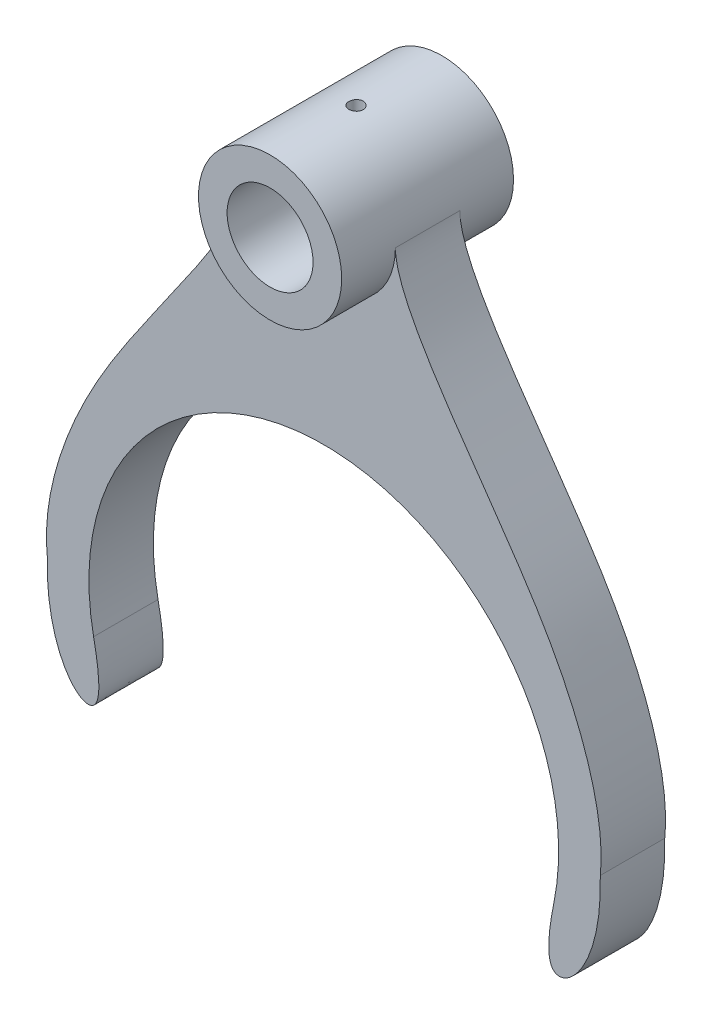
ISO-10303-21;
HEADER;
FILE_DESCRIPTION(('STEP AP214'),'2;1');
FILE_NAME('part.step','',(''),(''),'','','');
FILE_SCHEMA(('AUTOMOTIVE_DESIGN { 1 0 10303 214 1 1 1 1 }'));
ENDSEC;
DATA;
#1=APPLICATION_CONTEXT('core data for automotive mechanical design processes');
#2=APPLICATION_PROTOCOL_DEFINITION('international standard','automotive_design',2000,#1);
#3=PRODUCT_CONTEXT('',#1,'mechanical');
#4=PRODUCT('Part','Part','',(#3));
#5=PRODUCT_RELATED_PRODUCT_CATEGORY('part','',(#4));
#6=PRODUCT_DEFINITION_FORMATION('','',#4);
#7=PRODUCT_DEFINITION_CONTEXT('part definition',#1,'design');
#8=PRODUCT_DEFINITION('design','',#6,#7);
#9=PRODUCT_DEFINITION_SHAPE('','',#8);
#10=(LENGTH_UNIT() NAMED_UNIT(*) SI_UNIT(.MILLI.,.METRE.));
#11=(NAMED_UNIT(*) PLANE_ANGLE_UNIT() SI_UNIT($,.RADIAN.));
#12=(NAMED_UNIT(*) SI_UNIT($,.STERADIAN.) SOLID_ANGLE_UNIT());
#13=UNCERTAINTY_MEASURE_WITH_UNIT(LENGTH_MEASURE(1.E-05),#10,'distance_accuracy_value','');
#14=(GEOMETRIC_REPRESENTATION_CONTEXT(3) GLOBAL_UNCERTAINTY_ASSIGNED_CONTEXT((#13)) GLOBAL_UNIT_ASSIGNED_CONTEXT((#10,
#11,#12)) REPRESENTATION_CONTEXT('',''));
#15=CARTESIAN_POINT('',(0.,0.,0.));
#16=DIRECTION('',(0.,0.,1.));
#17=DIRECTION('',(1.,0.,0.));
#18=AXIS2_PLACEMENT_3D('',#15,#16,#17);
#19=CARTESIAN_POINT('',(0.,154.,30.));
#20=DIRECTION('',(0.,0.,-1.));
#21=DIRECTION('',(-1.,0.,0.));
#22=AXIS2_PLACEMENT_3D('',#19,#20,#21);
#23=CYLINDRICAL_SURFACE('',#22,15.);
#24=CARTESIAN_POINT('',(0.,154.,-30.));
#25=DIRECTION('',(0.,0.,1.));
#26=DIRECTION('',(1.,0.,0.));
#27=AXIS2_PLACEMENT_3D('',#24,#25,#26);
#28=CIRCLE('',#27,15.);
#29=CARTESIAN_POINT('',(15.,154.,-30.));
#30=VERTEX_POINT('',#29);
#31=EDGE_CURVE('E238',#30,#30,#28,.T.);
#32=ORIENTED_EDGE('',*,*,#31,.F.);
#33=EDGE_LOOP('',(#32));
#34=FACE_BOUND('',#33,.T.);
#35=CARTESIAN_POINT('',(0.,154.,30.));
#36=DIRECTION('',(0.,0.,1.));
#37=DIRECTION('',(1.,0.,0.));
#38=AXIS2_PLACEMENT_3D('',#35,#36,#37);
#39=CIRCLE('',#38,15.);
#40=CARTESIAN_POINT('',(15.,154.,30.));
#41=VERTEX_POINT('',#40);
#42=EDGE_CURVE('E237',#41,#41,#39,.T.);
#43=ORIENTED_EDGE('',*,*,#42,.T.);
#44=EDGE_LOOP('',(#43));
#45=FACE_BOUND('',#44,.T.);
#46=CARTESIAN_POINT('',(0.,169.,-2.5));
#47=CARTESIAN_POINT('',(-0.139390904958215,168.999997611688,-2.49999441105218));
#48=CARTESIAN_POINT('',(-0.278857881838821,168.99803677913,-2.48830272503108));
#49=CARTESIAN_POINT('',(-0.553880221673042,168.990403449414,-2.44186434123468));
#50=CARTESIAN_POINT('',(-0.689431867959247,168.984727539239,-2.4070964430884));
#51=CARTESIAN_POINT('',(-0.952604747212644,168.970300682365,-2.31558455140725));
#52=CARTESIAN_POINT('',(-1.0802323684319,168.961552251592,-2.25885853435943));
#53=CARTESIAN_POINT('',(-1.32414184197794,168.941942270821,-2.1250877079476));
#54=CARTESIAN_POINT('',(-1.44042498987859,168.931080962544,-2.048045222517));
#55=CARTESIAN_POINT('',(-1.65947261429168,168.908333174583,-1.87504491617954));
#56=CARTESIAN_POINT('',(-1.76211290353497,168.896438718149,-1.77893088536387));
#57=CARTESIAN_POINT('',(-1.94988849865993,168.873026268767,-1.57085203152719));
#58=CARTESIAN_POINT('',(-2.03502269939097,168.861508299627,-1.45888620854339));
#59=CARTESIAN_POINT('',(-2.18586712560513,168.840075657598,-1.22142903380294));
#60=CARTESIAN_POINT('',(-2.251454552861,168.830171290916,-1.09585866319524));
#61=CARTESIAN_POINT('',(-2.36055836541122,168.813197897947,-0.835290435699374));
#62=CARTESIAN_POINT('',(-2.40407624156561,168.806128680143,-0.700293216322368));
#63=CARTESIAN_POINT('',(-2.46741437778481,168.795705368428,-0.426019725143461));
#64=CARTESIAN_POINT('',(-2.4874490291354,168.792317684857,-0.286794263498608));
#65=CARTESIAN_POINT('',(-2.50391672528988,168.789539389366,-0.00691972311652882));
#66=CARTESIAN_POINT('',(-2.500351440389,168.790148494572,0.133729254167299));
#67=CARTESIAN_POINT('',(-2.46989509839615,168.795264288636,0.410927861275448));
#68=CARTESIAN_POINT('',(-2.44324488188977,168.799730733189,0.547504803545233));
#69=CARTESIAN_POINT('',(-2.36775314040345,168.81199495211,0.814221317829133));
#70=CARTESIAN_POINT('',(-2.31891085431974,168.819792840733,0.944360668888546));
#71=CARTESIAN_POINT('',(-2.20017724609391,168.837884793341,1.19522882344092));
#72=CARTESIAN_POINT('',(-2.13018591387972,168.848190671073,1.31590940608122));
#73=CARTESIAN_POINT('',(-1.97121201755744,168.87012918415,1.54390440053838));
#74=CARTESIAN_POINT('',(-1.88222792065429,168.881761926543,1.65121773245493));
#75=CARTESIAN_POINT('',(-1.68648221215905,168.905220278798,1.85082608580735));
#76=CARTESIAN_POINT('',(-1.57951396387313,168.917046492317,1.94291851854008));
#77=CARTESIAN_POINT('',(-1.35153524898165,168.939426013967,2.10787776266534));
#78=CARTESIAN_POINT('',(-1.23052469190642,168.949979313898,2.18074445018323));
#79=CARTESIAN_POINT('',(-0.977705916166711,168.968638928929,2.30520222713628));
#80=CARTESIAN_POINT('',(-0.845888725564661,168.976743184074,2.35677541933126));
#81=CARTESIAN_POINT('',(-0.575298345602731,168.989575030127,2.43699421524598));
#82=CARTESIAN_POINT('',(-0.436525739179468,168.994302903505,2.46564173697372));
#83=CARTESIAN_POINT('',(-0.157709901301623,168.999811298427,2.49892135846113));
#84=CARTESIAN_POINT('',(-0.0177007371510113,169.000637530128,2.50383157180561));
#85=CARTESIAN_POINT('',(0.261139772889887,168.998374744212,2.49023865557188));
#86=CARTESIAN_POINT('',(0.399971163892038,168.995285877241,2.47173642686626));
#87=CARTESIAN_POINT('',(0.671656175546764,168.985568269382,2.41207515066452));
#88=CARTESIAN_POINT('',(0.80454086838538,168.978961048013,2.37105379160987));
#89=CARTESIAN_POINT('',(1.06154688486044,168.962944644554,2.26766548180047));
#90=CARTESIAN_POINT('',(1.18566771590972,168.95353530512,2.20529733236473));
#91=CARTESIAN_POINT('',(1.42283068946896,168.932845163024,2.06034887530321));
#92=CARTESIAN_POINT('',(1.53576525093715,168.92154855887,1.97759484383275));
#93=CARTESIAN_POINT('',(1.74624358550269,168.898384673919,1.79446268461494));
#94=CARTESIAN_POINT('',(1.84378623969658,168.886517351715,1.69408327672333));
#95=CARTESIAN_POINT('',(2.021742779658,168.863401752358,1.47730245192858));
#96=CARTESIAN_POINT('',(2.10196876111372,168.852161161371,1.36074583448559));
#97=CARTESIAN_POINT('',(2.24170231029499,168.831715297779,1.11564703086146));
#98=CARTESIAN_POINT('',(2.30121053476982,168.82250996066,0.987105224772504));
#99=CARTESIAN_POINT('',(2.39753833147315,168.807234536977,0.722210267187867));
#100=CARTESIAN_POINT('',(2.43445143254795,168.801151543111,0.585891904969511));
#101=CARTESIAN_POINT('',(2.48483545377828,168.792777168353,0.308879870778237));
#102=CARTESIAN_POINT('',(2.49830841194617,168.790485457827,0.168186580267947));
#103=CARTESIAN_POINT('',(2.50137286604735,168.78996733084,-0.11170516596241));
#104=CARTESIAN_POINT('',(2.49126013612519,168.791690565057,-0.25090037857529));
#105=CARTESIAN_POINT('',(2.44807983895685,168.798897814537,-0.525579248050767));
#106=CARTESIAN_POINT('',(2.41501234611248,168.804381817612,-0.661062916941873));
#107=CARTESIAN_POINT('',(2.3269744895949,168.818473562817,-0.924358437292616));
#108=CARTESIAN_POINT('',(2.27202959060044,168.827077672197,-1.05217901005603));
#109=CARTESIAN_POINT('',(2.14182700391591,168.846443689222,-1.29683566919485));
#110=CARTESIAN_POINT('',(2.06656830874856,168.857205703884,-1.41367121037214));
#111=CARTESIAN_POINT('',(1.89681888437215,168.879834540456,-1.63453558310776));
#112=CARTESIAN_POINT('',(1.80211056359364,168.891712955763,-1.73839601670028));
#113=CARTESIAN_POINT('',(1.59660903138023,168.915143723608,-1.92885160447494));
#114=CARTESIAN_POINT('',(1.48581211291263,168.926696000266,-2.01544276863817));
#115=CARTESIAN_POINT('',(1.25036916964028,168.948265296422,-2.16944826819995));
#116=CARTESIAN_POINT('',(1.12563278753281,168.958271162531,-2.23672603931295));
#117=CARTESIAN_POINT('',(0.866513069378977,168.975511676018,-2.34926948460992));
#118=CARTESIAN_POINT('',(0.732139494830006,168.982749081775,-2.3945570810797));
#119=CARTESIAN_POINT('',(0.497703310045399,168.99205790833,-2.45200527412667));
#120=CARTESIAN_POINT('',(0.399058830298446,168.995020272734,-2.46997446961596));
#121=CARTESIAN_POINT('',(0.200289310319808,168.998992159861,-2.49397373784475));
#122=CARTESIAN_POINT('',(0.100164295608494,169.000001716206,-2.50000401613736));
#123=CARTESIAN_POINT('',(0.,169.,-2.5));
#124=B_SPLINE_CURVE_WITH_KNOTS('',3,(#46,#47,#48,#49,#50,#51,#52,#53,#54,#55,#56,#57,#58,#59,
#60,#61,#62,#63,#64,#65,#66,#67,#68,#69,#70,#71,#72,#73,#74,#75,#76,#77,#78,#79,#80,#81,#82,#83,
#84,#85,#86,#87,#88,#89,#90,#91,#92,#93,#94,#95,#96,#97,#98,#99,#100,#101,#102,#103,#104,#105,
#106,#107,#108,#109,#110,#111,#112,#113,#114,#115,#116,#117,#118,#119,#120,#121,#122,#123),
.UNSPECIFIED.,.T.,.F.,(4,2,2,2,2,2,2,2,2,2,2,2,2,2,2,2,2,2,2,2,2,2,2,2,2,2,2,2,2,2,2,2,2,2,2,2,
2,2,4),(0.,0.417806584938509,0.83599754569542,1.25384686702527,1.67164841267479,
2.09302491062332,2.51442800169856,2.9384252082384,3.36239376876181,3.78246077103424,
4.20249804320886,4.61820521760409,5.03392665025381,5.45164556632557,5.86939820680573,
6.29232769911326,6.71525991635847,7.13854688915903,7.56179844521149,7.98007883491397,
8.39834313035859,8.81407807006415,9.22983635826066,9.64926825627024,10.0687306305428,
10.4925382200762,10.9163323737594,11.3383602234177,11.7603513778662,12.177079095227,
12.5938054618813,13.0100481822622,13.4263115502934,13.8475138419339,14.2688133387897,
14.693022316072,15.1168075213007,15.4170424816402,15.7172722727697),.UNSPECIFIED.);
#125=CARTESIAN_POINT('',(0.,169.,-2.5));
#126=VERTEX_POINT('',#125);
#127=EDGE_CURVE('E242',#126,#126,#124,.T.);
#128=ORIENTED_EDGE('',*,*,#127,.T.);
#129=EDGE_LOOP('',(#128));
#130=FACE_BOUND('',#129,.T.);
#131=ADVANCED_FACE('F45',(#34,#45,#130),#23,.F.);
#132=CARTESIAN_POINT('',(0.,154.,30.));
#133=DIRECTION('',(0.,0.,-1.));
#134=DIRECTION('',(-1.,0.,0.));
#135=AXIS2_PLACEMENT_3D('',#132,#133,#134);
#136=CYLINDRICAL_SURFACE('',#135,25.);
#137=CARTESIAN_POINT('',(0.,154.,11.25));
#138=DIRECTION('',(0.,0.,1.));
#139=DIRECTION('',(1.,0.,0.));
#140=AXIS2_PLACEMENT_3D('',#137,#138,#139);
#141=CIRCLE('',#140,25.);
#142=CARTESIAN_POINT('',(-25.,154.,11.25));
#143=VERTEX_POINT('',#142);
#144=CARTESIAN_POINT('',(25.,154.,11.25));
#145=VERTEX_POINT('',#144);
#146=EDGE_CURVE('E219',#143,#145,#141,.T.);
#147=ORIENTED_EDGE('',*,*,#146,.T.);
#148=DIRECTION('',(0.,0.,-1.));
#149=VECTOR('',#148,1.);
#150=CARTESIAN_POINT('',(25.,154.,11.25));
#151=LINE('',#150,#149);
#152=CARTESIAN_POINT('',(25.,154.,-11.25));
#153=VERTEX_POINT('',#152);
#154=EDGE_CURVE('E116',#145,#153,#151,.T.);
#155=ORIENTED_EDGE('',*,*,#154,.T.);
#156=CARTESIAN_POINT('',(0.,154.,-11.25));
#157=DIRECTION('',(0.,0.,1.));
#158=DIRECTION('',(1.,0.,0.));
#159=AXIS2_PLACEMENT_3D('',#156,#157,#158);
#160=CIRCLE('',#159,25.);
#161=CARTESIAN_POINT('',(-25.,154.,-11.25));
#162=VERTEX_POINT('',#161);
#163=EDGE_CURVE('E109',#162,#153,#160,.T.);
#164=ORIENTED_EDGE('',*,*,#163,.F.);
#165=DIRECTION('',(0.,0.,-1.));
#166=VECTOR('',#165,1.);
#167=CARTESIAN_POINT('',(-25.,154.,11.25));
#168=LINE('',#167,#166);
#169=EDGE_CURVE('E113',#143,#162,#168,.T.);
#170=ORIENTED_EDGE('',*,*,#169,.F.);
#171=EDGE_LOOP('',(#147,#155,#164,#170));
#172=FACE_BOUND('',#171,.T.);
#173=CARTESIAN_POINT('',(0.,154.,30.));
#174=DIRECTION('',(0.,0.,1.));
#175=DIRECTION('',(1.,0.,0.));
#176=AXIS2_PLACEMENT_3D('',#173,#174,#175);
#177=CIRCLE('',#176,25.);
#178=CARTESIAN_POINT('',(25.,154.,30.));
#179=VERTEX_POINT('',#178);
#180=EDGE_CURVE('E171',#179,#179,#177,.T.);
#181=ORIENTED_EDGE('',*,*,#180,.F.);
#182=EDGE_LOOP('',(#181));
#183=FACE_BOUND('',#182,.T.);
#184=CARTESIAN_POINT('',(0.,154.,-30.));
#185=DIRECTION('',(0.,0.,1.));
#186=DIRECTION('',(1.,0.,0.));
#187=AXIS2_PLACEMENT_3D('',#184,#185,#186);
#188=CIRCLE('',#187,25.);
#189=CARTESIAN_POINT('',(25.,154.,-30.));
#190=VERTEX_POINT('',#189);
#191=EDGE_CURVE('E233',#190,#190,#188,.T.);
#192=ORIENTED_EDGE('',*,*,#191,.T.);
#193=EDGE_LOOP('',(#192));
#194=FACE_BOUND('',#193,.T.);
#195=CARTESIAN_POINT('',(0.,179.,-2.5));
#196=CARTESIAN_POINT('',(-0.140050884478893,178.999998388019,-2.49999393524905));
#197=CARTESIAN_POINT('',(-0.280194362919432,178.998810639905,-2.48819182775889));
#198=CARTESIAN_POINT('',(-0.556595996242092,178.994186689868,-2.44128907427393));
#199=CARTESIAN_POINT('',(-0.69284969792207,178.990748010851,-2.40616275993853));
#200=CARTESIAN_POINT('',(-0.957429188633536,178.982010364077,-2.31364439850542));
#201=CARTESIAN_POINT('',(-1.08575971153727,178.976712520018,-2.25626579870381));
#202=CARTESIAN_POINT('',(-1.33094040240102,178.964848934858,-2.12089773017089));
#203=CARTESIAN_POINT('',(-1.44779284694769,178.958283445953,-2.04291235999965));
#204=CARTESIAN_POINT('',(-1.66714887668521,178.944593608533,-1.86824325584431));
#205=CARTESIAN_POINT('',(-1.76960536208723,178.937467539347,-1.77150050149491));
#206=CARTESIAN_POINT('',(-1.95685630357746,178.923473922657,-1.56218866434242));
#207=CARTESIAN_POINT('',(-2.04164994270663,178.916606387123,-1.44961884989403));
#208=CARTESIAN_POINT('',(-2.19133492610904,178.90388978882,-1.21155367079095));
#209=CARTESIAN_POINT('',(-2.2561836636372,178.898042917773,-1.08603138976285));
#210=CARTESIAN_POINT('',(-2.3638659618569,178.888050938663,-0.825811035237551));
#211=CARTESIAN_POINT('',(-2.40670006647823,178.883905788556,-0.691113188540124));
#212=CARTESIAN_POINT('',(-2.46899760400473,178.877802101824,-0.416845497834975));
#213=CARTESIAN_POINT('',(-2.48853913250949,178.875836259952,-0.277293557869479));
#214=CARTESIAN_POINT('',(-2.5039382128384,178.874291076513,0.0031221584894524));
#215=CARTESIAN_POINT('',(-2.499796387177,178.874711672219,0.143985900305149));
#216=CARTESIAN_POINT('',(-2.4680107006317,178.877885172473,0.422488274233297));
#217=CARTESIAN_POINT('',(-2.44045211031138,178.880629614766,0.560136748321736));
#218=CARTESIAN_POINT('',(-2.36274786037646,178.888128357185,0.828844908002736));
#219=CARTESIAN_POINT('',(-2.31260189563936,178.892882684462,0.959904504562579));
#220=CARTESIAN_POINT('',(-2.19105223470377,178.903875236302,1.21198396824722));
#221=CARTESIAN_POINT('',(-2.11961070679995,178.910116097704,1.33298547372329));
#222=CARTESIAN_POINT('',(-1.95752506838307,178.923376293322,1.56131303727971));
#223=CARTESIAN_POINT('',(-1.86688039584126,178.93039565032,1.66863869495441));
#224=CARTESIAN_POINT('',(-1.66848528103017,178.944459632825,1.86706348497257));
#225=CARTESIAN_POINT('',(-1.56066119712841,178.951504233325,1.95808900470201));
#226=CARTESIAN_POINT('',(-1.33122370434278,178.964795726963,2.12075908227597));
#227=CARTESIAN_POINT('',(-1.209610279999,178.971042619206,2.19240361839119));
#228=CARTESIAN_POINT('',(-0.955995264230911,178.982036891677,2.31427505077563));
#229=CARTESIAN_POINT('',(-0.823991865974757,178.986784010369,2.36449821204515));
#230=CARTESIAN_POINT('',(-0.553368043324829,178.994241186035,2.44204729177938));
#231=CARTESIAN_POINT('',(-0.4147478169415,178.996951303927,2.46937389497656));
#232=CARTESIAN_POINT('',(-0.135462747729759,179.000021291708,2.50026076933691));
#233=CARTESIAN_POINT('',(0.00519075526373084,179.000391206693,2.50392262063125));
#234=CARTESIAN_POINT('',(0.28510948328925,178.99876604392,2.48764284237809));
#235=CARTESIAN_POINT('',(0.424374727051175,178.996770998112,2.4677015317118));
#236=CARTESIAN_POINT('',(0.697270517086686,178.99064653848,2.40486576144606));
#237=CARTESIAN_POINT('',(0.830912122430047,178.986521547951,2.36201886380497));
#238=CARTESIAN_POINT('',(1.08911080345945,178.976599971515,2.25463706490682));
#239=CARTESIAN_POINT('',(1.21366767539279,178.970803348131,2.19010167740151));
#240=CARTESIAN_POINT('',(1.45062045043035,178.958161883261,2.04092290334022));
#241=CARTESIAN_POINT('',(1.56297414937229,178.951313590086,1.95621277768546));
#242=CARTESIAN_POINT('',(1.77190405827969,178.937348321738,1.76918483064768));
#243=CARTESIAN_POINT('',(1.86847987212294,178.930231339824,1.66686656732421));
#244=CARTESIAN_POINT('',(2.04346527471786,178.916500603519,1.4470835633525));
#245=CARTESIAN_POINT('',(2.12180819669886,178.909888753474,1.32956560864345));
#246=CARTESIAN_POINT('',(2.25764564685957,178.897945811522,1.08298159963329));
#247=CARTESIAN_POINT('',(2.31514046013471,178.892614702101,0.95391570327901));
#248=CARTESIAN_POINT('',(2.40753802171119,178.883848690851,0.688128151335515));
#249=CARTESIAN_POINT('',(2.44248043702965,178.880410461245,0.551420399772198));
#250=CARTESIAN_POINT('',(2.48891001782366,178.875809132072,0.27404200509807));
#251=CARTESIAN_POINT('',(2.50039785599879,178.874645967255,0.133371475760815));
#252=CARTESIAN_POINT('',(2.49958284617814,178.874727827689,-0.147276720891762));
#253=CARTESIAN_POINT('',(2.48738472398278,178.875962252175,-0.287254707207038));
#254=CARTESIAN_POINT('',(2.43976363240913,178.880677597239,-0.56316229292072));
#255=CARTESIAN_POINT('',(2.4043406369054,178.884158520343,-0.699091887764949));
#256=CARTESIAN_POINT('',(2.31130421574376,178.89297170658,-0.963043372619642));
#257=CARTESIAN_POINT('',(2.25369386085229,178.898303713509,-1.09106635407431));
#258=CARTESIAN_POINT('',(2.11792888727761,178.910218795984,-1.33564222917759));
#259=CARTESIAN_POINT('',(2.03977438363854,178.916801864524,-1.45219518705157));
#260=CARTESIAN_POINT('',(1.86474639071333,178.930512180242,-1.67105918617984));
#261=CARTESIAN_POINT('',(1.76779487222567,178.937641618169,-1.77330769091772));
#262=CARTESIAN_POINT('',(1.55807924806277,178.95162136822,-1.96013058174914));
#263=CARTESIAN_POINT('',(1.44531136027064,178.958471613074,-2.04470072839292));
#264=CARTESIAN_POINT('',(1.20685358540322,178.971139051729,-2.19393363463655));
#265=CARTESIAN_POINT('',(1.08113187336691,178.97695360067,-2.25854572736296));
#266=CARTESIAN_POINT('',(0.820645697751378,178.986865731247,-2.36565605705967));
#267=CARTESIAN_POINT('',(0.685891624564023,178.990965247741,-2.40817922738387));
#268=CARTESIAN_POINT('',(0.45864565351426,178.995955344343,-2.459301542712));
#269=CARTESIAN_POINT('',(0.367606382111272,178.997465017296,-2.47454261074839));
#270=CARTESIAN_POINT('',(0.184391452043283,178.99948787377,-2.4948938151544));
#271=CARTESIAN_POINT('',(0.0922157980663947,179.000001061401,-2.50000399330465));
#272=CARTESIAN_POINT('',(0.,179.,-2.5));
#273=B_SPLINE_CURVE_WITH_KNOTS('',3,(#195,#196,#197,#198,#199,#200,#201,#202,#203,#204,#205,
#206,#207,#208,#209,#210,#211,#212,#213,#214,#215,#216,#217,#218,#219,#220,#221,#222,#223,#224,
#225,#226,#227,#228,#229,#230,#231,#232,#233,#234,#235,#236,#237,#238,#239,#240,#241,#242,#243,
#244,#245,#246,#247,#248,#249,#250,#251,#252,#253,#254,#255,#256,#257,#258,#259,#260,#261,#262,
#263,#264,#265,#266,#267,#268,#269,#270,#271,#272),.UNSPECIFIED.,.T.,.F.,(4,2,2,2,2,2,2,2,2,2,2,
2,2,2,2,2,2,2,2,2,2,2,2,2,2,2,2,2,2,2,2,2,2,2,2,2,2,2,4),(0.,0.419815915671184,
0.840094607088716,1.26011971433051,1.68006134395696,2.10134642155737,2.52265098051765,
2.94484938680555,3.3670373610626,3.78780580112992,4.20856318139441,4.62779493602776,
5.04703235404084,5.46701903432237,5.88701800827813,6.30886835490517,6.7307191744943,
7.15264351733954,7.57455524188599,7.99465471519394,8.41474851297859,8.83397338235762,
9.25320765123667,9.67384851871746,10.0944999452557,10.516666090215,10.9388264618844,
11.3602422648251,11.7816459809896,12.2011907323489,12.620735955651,13.04022313407,
13.459707963474,13.8809729356913,14.3023388159239,14.7247657756561,15.1467148698824,
15.4231416808087,15.6995673517257),.UNSPECIFIED.);
#274=CARTESIAN_POINT('',(0.,179.,-2.5));
#275=VERTEX_POINT('',#274);
#276=EDGE_CURVE('E11',#275,#275,#273,.T.);
#277=ORIENTED_EDGE('',*,*,#276,.F.);
#278=EDGE_LOOP('',(#277));
#279=FACE_BOUND('',#278,.T.);
#280=ADVANCED_FACE('F111',(#172,#183,#194,#279),#136,.T.);
#281=CARTESIAN_POINT('',(0.,0.,11.25));
#282=DIRECTION('',(0.,0.,-1.));
#283=DIRECTION('',(-1.,0.,0.));
#284=AXIS2_PLACEMENT_3D('',#281,#282,#283);
#285=CYLINDRICAL_SURFACE('',#284,82.);
#286=CARTESIAN_POINT('',(0.,0.,-11.25));
#287=DIRECTION('',(0.,0.,1.));
#288=DIRECTION('',(1.,0.,0.));
#289=AXIS2_PLACEMENT_3D('',#286,#287,#288);
#290=CIRCLE('',#289,82.);
#291=CARTESIAN_POINT('',(80.3693461483978,-16.271699348225,-11.25));
#292=VERTEX_POINT('',#291);
#293=CARTESIAN_POINT('',(-80.3693461483978,-16.271699348225,-11.25));
#294=VERTEX_POINT('',#293);
#295=EDGE_CURVE('E169',#292,#294,#290,.T.);
#296=ORIENTED_EDGE('',*,*,#295,.F.);
#297=DIRECTION('',(0.,0.,-1.));
#298=VECTOR('',#297,1.);
#299=CARTESIAN_POINT('',(80.3693461483978,-16.271699348225,11.25));
#300=LINE('',#299,#298);
#301=CARTESIAN_POINT('',(80.3693461483978,-16.271699348225,11.25));
#302=VERTEX_POINT('',#301);
#303=EDGE_CURVE('E60',#302,#292,#300,.T.);
#304=ORIENTED_EDGE('',*,*,#303,.F.);
#305=CARTESIAN_POINT('',(0.,0.,11.25));
#306=DIRECTION('',(0.,0.,1.));
#307=DIRECTION('',(1.,0.,0.));
#308=AXIS2_PLACEMENT_3D('',#305,#306,#307);
#309=CIRCLE('',#308,82.);
#310=CARTESIAN_POINT('',(-80.3693461483978,-16.271699348225,11.25));
#311=VERTEX_POINT('',#310);
#312=EDGE_CURVE('E138',#302,#311,#309,.T.);
#313=ORIENTED_EDGE('',*,*,#312,.T.);
#314=DIRECTION('',(0.,0.,-1.));
#315=VECTOR('',#314,1.);
#316=CARTESIAN_POINT('',(-80.3693461483978,-16.271699348225,11.25));
#317=LINE('',#316,#315);
#318=EDGE_CURVE('E95',#311,#294,#317,.T.);
#319=ORIENTED_EDGE('',*,*,#318,.T.);
#320=EDGE_LOOP('',(#296,#304,#313,#319));
#321=FACE_BOUND('',#320,.T.);
#322=ADVANCED_FACE('F47',(#321),#285,.F.);
#323=CARTESIAN_POINT('',(96.5397451551416,0.,11.25));
#324=CARTESIAN_POINT('',(97.326558794436,-29.3315351381724,11.25));
#325=CARTESIAN_POINT('',(77.4734920497256,-47.5739427436133,11.25));
#326=CARTESIAN_POINT('',(78.1124793524224,-27.4188392292452,11.25));
#327=CARTESIAN_POINT('',(80.3693461483977,-16.271699348225,11.25));
#328=B_SPLINE_CURVE_WITH_KNOTS('',3,(#323,#324,#325,#326,#327),.UNSPECIFIED.,.F.,.F.,(4,1,4),
(0.,0.663724028871257,1.),.UNSPECIFIED.);
#329=DIRECTION('',(0.,0.,-1.));
#330=VECTOR('',#329,1.);
#331=SURFACE_OF_LINEAR_EXTRUSION('',#328,#330);
#332=CARTESIAN_POINT('',(96.5397451551416,0.,-11.25));
#333=CARTESIAN_POINT('',(97.326558794436,-29.3315351381724,-11.25));
#334=CARTESIAN_POINT('',(77.4734920497256,-47.5739427436133,-11.25));
#335=CARTESIAN_POINT('',(78.1124793524224,-27.4188392292452,-11.25));
#336=CARTESIAN_POINT('',(80.3693461483977,-16.271699348225,-11.25));
#337=B_SPLINE_CURVE_WITH_KNOTS('',3,(#332,#333,#334,#335,#336),.UNSPECIFIED.,.F.,.F.,(4,1,4),
(0.,0.663724028871257,1.),.UNSPECIFIED.);
#338=CARTESIAN_POINT('',(96.5397451551416,0.,-11.25));
#339=VERTEX_POINT('',#338);
#340=EDGE_CURVE('E166',#339,#292,#337,.T.);
#341=ORIENTED_EDGE('',*,*,#340,.F.);
#342=DIRECTION('',(0.,0.,-1.));
#343=VECTOR('',#342,1.);
#344=CARTESIAN_POINT('',(96.5397451551416,0.,11.25));
#345=LINE('',#344,#343);
#346=CARTESIAN_POINT('',(96.5397451551416,0.,11.25));
#347=VERTEX_POINT('',#346);
#348=EDGE_CURVE('E158',#347,#339,#345,.T.);
#349=ORIENTED_EDGE('',*,*,#348,.F.);
#350=EDGE_CURVE('E168',#347,#302,#328,.T.);
#351=ORIENTED_EDGE('',*,*,#350,.T.);
#352=ORIENTED_EDGE('',*,*,#303,.T.);
#353=EDGE_LOOP('',(#341,#349,#351,#352));
#354=FACE_BOUND('',#353,.T.);
#355=ADVANCED_FACE('F164',(#354),#331,.T.);
#356=CARTESIAN_POINT('',(96.5397451551416,0.,11.25));
#357=CARTESIAN_POINT('',(96.4933319207442,1.73023362536728,11.25));
#358=CARTESIAN_POINT('',(104.346209231327,42.2228603518084,11.25));
#359=CARTESIAN_POINT('',(25.,135.629553039424,11.25));
#360=CARTESIAN_POINT('',(25.,154.,11.25));
#361=B_SPLINE_CURVE_WITH_KNOTS('',3,(#356,#357,#358,#359,#360),.UNSPECIFIED.,.F.,.F.,(4,1,4),
(0.,0.598565742576659,1.),.UNSPECIFIED.);
#362=DIRECTION('',(0.,0.,-1.));
#363=VECTOR('',#362,1.);
#364=SURFACE_OF_LINEAR_EXTRUSION('',#361,#363);
#365=CARTESIAN_POINT('',(96.5397451551416,0.,-11.25));
#366=CARTESIAN_POINT('',(96.4933319207442,1.73023362536728,-11.25));
#367=CARTESIAN_POINT('',(104.346209231327,42.2228603518084,-11.25));
#368=CARTESIAN_POINT('',(25.,135.629553039424,-11.25));
#369=CARTESIAN_POINT('',(25.,154.,-11.25));
#370=B_SPLINE_CURVE_WITH_KNOTS('',3,(#365,#366,#367,#368,#369),.UNSPECIFIED.,.F.,.F.,(4,1,4),
(0.,0.598565742576659,1.),.UNSPECIFIED.);
#371=EDGE_CURVE('E123',#339,#153,#370,.T.);
#372=ORIENTED_EDGE('',*,*,#371,.T.);
#373=ORIENTED_EDGE('',*,*,#154,.F.);
#374=EDGE_CURVE('E213',#347,#145,#361,.T.);
#375=ORIENTED_EDGE('',*,*,#374,.F.);
#376=ORIENTED_EDGE('',*,*,#348,.T.);
#377=EDGE_LOOP('',(#372,#373,#375,#376));
#378=FACE_BOUND('',#377,.T.);
#379=ADVANCED_FACE('F208',(#378),#364,.F.);
#380=CARTESIAN_POINT('',(-96.5397451551416,0.,11.25));
#381=CARTESIAN_POINT('',(-96.4933319207442,1.73023362536728,11.25));
#382=CARTESIAN_POINT('',(-104.346209231327,42.2228603518084,11.25));
#383=CARTESIAN_POINT('',(-25.,135.629553039424,11.25));
#384=CARTESIAN_POINT('',(-25.,154.,11.25));
#385=B_SPLINE_CURVE_WITH_KNOTS('',3,(#380,#381,#382,#383,#384),.UNSPECIFIED.,.F.,.F.,(4,1,4),
(0.,0.598565742576659,1.),.UNSPECIFIED.);
#386=DIRECTION('',(0.,0.,-1.));
#387=VECTOR('',#386,1.);
#388=SURFACE_OF_LINEAR_EXTRUSION('',#385,#387);
#389=CARTESIAN_POINT('',(-96.5397451551416,0.,-11.25));
#390=CARTESIAN_POINT('',(-96.4933319207442,1.73023362536728,-11.25));
#391=CARTESIAN_POINT('',(-104.346209231327,42.2228603518084,-11.25));
#392=CARTESIAN_POINT('',(-25.,135.629553039424,-11.25));
#393=CARTESIAN_POINT('',(-25.,154.,-11.25));
#394=B_SPLINE_CURVE_WITH_KNOTS('',3,(#389,#390,#391,#392,#393),.UNSPECIFIED.,.F.,.F.,(4,1,4),
(0.,0.598565742576659,1.),.UNSPECIFIED.);
#395=CARTESIAN_POINT('',(-96.5397451551416,0.,-11.25));
#396=VERTEX_POINT('',#395);
#397=EDGE_CURVE('E122',#396,#162,#394,.T.);
#398=ORIENTED_EDGE('',*,*,#397,.F.);
#399=DIRECTION('',(0.,0.,-1.));
#400=VECTOR('',#399,1.);
#401=CARTESIAN_POINT('',(-96.5397451551416,0.,11.25));
#402=LINE('',#401,#400);
#403=CARTESIAN_POINT('',(-96.5397451551416,0.,11.25));
#404=VERTEX_POINT('',#403);
#405=EDGE_CURVE('E88',#404,#396,#402,.T.);
#406=ORIENTED_EDGE('',*,*,#405,.F.);
#407=EDGE_CURVE('E129',#404,#143,#385,.T.);
#408=ORIENTED_EDGE('',*,*,#407,.T.);
#409=ORIENTED_EDGE('',*,*,#169,.T.);
#410=EDGE_LOOP('',(#398,#406,#408,#409));
#411=FACE_BOUND('',#410,.T.);
#412=ADVANCED_FACE('F128',(#411),#388,.T.);
#413=CARTESIAN_POINT('',(-96.5397451551416,0.,11.25));
#414=CARTESIAN_POINT('',(-97.326558794436,-29.3315351381724,11.25));
#415=CARTESIAN_POINT('',(-77.4734920497256,-47.5739427436132,11.25));
#416=CARTESIAN_POINT('',(-78.1124793524224,-27.4188392292452,11.25));
#417=CARTESIAN_POINT('',(-80.3693461483977,-16.271699348225,11.25));
#418=B_SPLINE_CURVE_WITH_KNOTS('',3,(#413,#414,#415,#416,#417),.UNSPECIFIED.,.F.,.F.,(4,1,4),
(0.,0.663724028871257,1.),.UNSPECIFIED.);
#419=DIRECTION('',(0.,0.,-1.));
#420=VECTOR('',#419,1.);
#421=SURFACE_OF_LINEAR_EXTRUSION('',#418,#420);
#422=CARTESIAN_POINT('',(-96.5397451551416,0.,-11.25));
#423=CARTESIAN_POINT('',(-97.326558794436,-29.3315351381724,-11.25));
#424=CARTESIAN_POINT('',(-77.4734920497256,-47.5739427436132,-11.25));
#425=CARTESIAN_POINT('',(-78.1124793524224,-27.4188392292452,-11.25));
#426=CARTESIAN_POINT('',(-80.3693461483977,-16.271699348225,-11.25));
#427=B_SPLINE_CURVE_WITH_KNOTS('',3,(#422,#423,#424,#425,#426),.UNSPECIFIED.,.F.,.F.,(4,1,4),
(0.,0.663724028871257,1.),.UNSPECIFIED.);
#428=EDGE_CURVE('E134',#396,#294,#427,.T.);
#429=ORIENTED_EDGE('',*,*,#428,.T.);
#430=ORIENTED_EDGE('',*,*,#318,.F.);
#431=EDGE_CURVE('E68',#404,#311,#418,.T.);
#432=ORIENTED_EDGE('',*,*,#431,.F.);
#433=ORIENTED_EDGE('',*,*,#405,.T.);
#434=EDGE_LOOP('',(#429,#430,#432,#433));
#435=FACE_BOUND('',#434,.T.);
#436=ADVANCED_FACE('F200',(#435),#421,.F.);
#437=CARTESIAN_POINT('',(0.,0.,11.25));
#438=DIRECTION('',(0.,0.,1.));
#439=DIRECTION('',(1.,0.,0.));
#440=AXIS2_PLACEMENT_3D('',#437,#438,#439);
#441=PLANE('',#440);
#442=ORIENTED_EDGE('',*,*,#312,.F.);
#443=ORIENTED_EDGE('',*,*,#350,.F.);
#444=ORIENTED_EDGE('',*,*,#374,.T.);
#445=ORIENTED_EDGE('',*,*,#146,.F.);
#446=ORIENTED_EDGE('',*,*,#407,.F.);
#447=ORIENTED_EDGE('',*,*,#431,.T.);
#448=EDGE_LOOP('',(#442,#443,#444,#445,#446,#447));
#449=FACE_BOUND('',#448,.T.);
#450=ADVANCED_FACE('F204',(#449),#441,.T.);
#451=CARTESIAN_POINT('',(0.,0.,-11.25));
#452=DIRECTION('',(0.,0.,1.));
#453=DIRECTION('',(1.,0.,0.));
#454=AXIS2_PLACEMENT_3D('',#451,#452,#453);
#455=PLANE('',#454);
#456=ORIENTED_EDGE('',*,*,#295,.T.);
#457=ORIENTED_EDGE('',*,*,#428,.F.);
#458=ORIENTED_EDGE('',*,*,#397,.T.);
#459=ORIENTED_EDGE('',*,*,#163,.T.);
#460=ORIENTED_EDGE('',*,*,#371,.F.);
#461=ORIENTED_EDGE('',*,*,#340,.T.);
#462=EDGE_LOOP('',(#456,#457,#458,#459,#460,#461));
#463=FACE_BOUND('',#462,.T.);
#464=ADVANCED_FACE('F133',(#463),#455,.F.);
#465=CARTESIAN_POINT('',(0.,0.,30.));
#466=DIRECTION('',(0.,0.,1.));
#467=DIRECTION('',(1.,0.,0.));
#468=AXIS2_PLACEMENT_3D('',#465,#466,#467);
#469=PLANE('',#468);
#470=ORIENTED_EDGE('',*,*,#42,.F.);
#471=EDGE_LOOP('',(#470));
#472=FACE_BOUND('',#471,.T.);
#473=ORIENTED_EDGE('',*,*,#180,.T.);
#474=EDGE_LOOP('',(#473));
#475=FACE_BOUND('',#474,.T.);
#476=ADVANCED_FACE('F262',(#472,#475),#469,.T.);
#477=CARTESIAN_POINT('',(0.,0.,-30.));
#478=DIRECTION('',(0.,0.,1.));
#479=DIRECTION('',(1.,0.,0.));
#480=AXIS2_PLACEMENT_3D('',#477,#478,#479);
#481=PLANE('',#480);
#482=ORIENTED_EDGE('',*,*,#31,.T.);
#483=EDGE_LOOP('',(#482));
#484=FACE_BOUND('',#483,.T.);
#485=ORIENTED_EDGE('',*,*,#191,.F.);
#486=EDGE_LOOP('',(#485));
#487=FACE_BOUND('',#486,.T.);
#488=ADVANCED_FACE('F260',(#484,#487),#481,.F.);
#489=CARTESIAN_POINT('',(0.,179.,0.));
#490=DIRECTION('',(0.,-1.,0.));
#491=DIRECTION('',(0.,0.,-1.));
#492=AXIS2_PLACEMENT_3D('',#489,#490,#491);
#493=CYLINDRICAL_SURFACE('',#492,2.5);
#494=ORIENTED_EDGE('',*,*,#127,.F.);
#495=EDGE_LOOP('',(#494));
#496=FACE_BOUND('',#495,.T.);
#497=ORIENTED_EDGE('',*,*,#276,.T.);
#498=EDGE_LOOP('',(#497));
#499=FACE_BOUND('',#498,.T.);
#500=ADVANCED_FACE('F256',(#496,#499),#493,.F.);
#501=CLOSED_SHELL('',(#131,#280,#322,#355,#379,#412,#436,#450,#464,#476,#488,#500));
#502=MANIFOLD_SOLID_BREP('B2',#501);
#503=ADVANCED_BREP_SHAPE_REPRESENTATION('',(#18,#502),#14);
#504=SHAPE_DEFINITION_REPRESENTATION(#9,#503);
ENDSEC;
END-ISO-10303-21;
